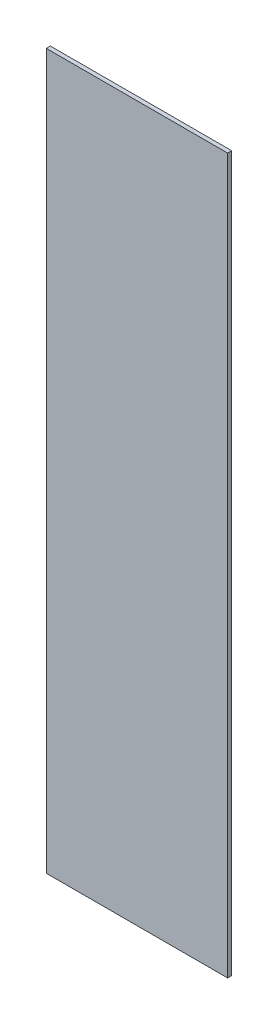
ISO-10303-21;
HEADER;
FILE_DESCRIPTION(('STEP AP214'),'2;1');
FILE_NAME('part.step','',(''),(''),'','','');
FILE_SCHEMA(('AUTOMOTIVE_DESIGN { 1 0 10303 214 1 1 1 1 }'));
ENDSEC;
DATA;
#1=APPLICATION_CONTEXT('core data for automotive mechanical design processes');
#2=APPLICATION_PROTOCOL_DEFINITION('international standard','automotive_design',2000,#1);
#3=PRODUCT_CONTEXT('',#1,'mechanical');
#4=PRODUCT('Part','Part','',(#3));
#5=PRODUCT_RELATED_PRODUCT_CATEGORY('part','',(#4));
#6=PRODUCT_DEFINITION_FORMATION('','',#4);
#7=PRODUCT_DEFINITION_CONTEXT('part definition',#1,'design');
#8=PRODUCT_DEFINITION('design','',#6,#7);
#9=PRODUCT_DEFINITION_SHAPE('','',#8);
#10=(LENGTH_UNIT() NAMED_UNIT(*) SI_UNIT(.MILLI.,.METRE.));
#11=(NAMED_UNIT(*) PLANE_ANGLE_UNIT() SI_UNIT($,.RADIAN.));
#12=(NAMED_UNIT(*) SI_UNIT($,.STERADIAN.) SOLID_ANGLE_UNIT());
#13=UNCERTAINTY_MEASURE_WITH_UNIT(LENGTH_MEASURE(1.E-05),#10,'distance_accuracy_value','');
#14=(GEOMETRIC_REPRESENTATION_CONTEXT(3) GLOBAL_UNCERTAINTY_ASSIGNED_CONTEXT((#13)) GLOBAL_UNIT_ASSIGNED_CONTEXT((#10,
#11,#12)) REPRESENTATION_CONTEXT('',''));
#15=CARTESIAN_POINT('',(0.,0.,0.));
#16=DIRECTION('',(0.,0.,1.));
#17=DIRECTION('',(1.,0.,0.));
#18=AXIS2_PLACEMENT_3D('',#15,#16,#17);
#19=CARTESIAN_POINT('',(-0.2868069251739,0.7412429894471,0.0009));
#20=DIRECTION('',(0.,1.,0.));
#21=DIRECTION('',(0.,0.,1.));
#22=AXIS2_PLACEMENT_3D('',#19,#20,#21);
#23=PLANE('',#22);
#24=DIRECTION('',(0.,0.,1.));
#25=VECTOR('',#24,1.);
#26=CARTESIAN_POINT('',(-0.3068107396239,0.7412429894471,0.));
#27=LINE('',#26,#25);
#28=CARTESIAN_POINT('',(-0.3068107396239,0.7412429894471,0.));
#29=VERTEX_POINT('',#28);
#30=CARTESIAN_POINT('',(-0.3068107396239,0.7412429894471,0.0009));
#31=VERTEX_POINT('',#30);
#32=EDGE_CURVE('E11',#29,#31,#27,.T.);
#33=ORIENTED_EDGE('',*,*,#32,.T.);
#34=DIRECTION('',(1.,0.,0.));
#35=VECTOR('',#34,1.);
#36=CARTESIAN_POINT('',(-0.3068107396239,0.7412429894471,0.0009));
#37=LINE('',#36,#35);
#38=CARTESIAN_POINT('',(-0.2668031107239,0.7412429894471,0.0009));
#39=VERTEX_POINT('',#38);
#40=EDGE_CURVE('E86',#31,#39,#37,.T.);
#41=ORIENTED_EDGE('',*,*,#40,.T.);
#42=DIRECTION('',(0.,0.,1.));
#43=VECTOR('',#42,1.);
#44=CARTESIAN_POINT('',(-0.2668031107239,0.7412429894471,0.));
#45=LINE('',#44,#43);
#46=CARTESIAN_POINT('',(-0.2668031107239,0.7412429894471,0.));
#47=VERTEX_POINT('',#46);
#48=EDGE_CURVE('E24',#47,#39,#45,.T.);
#49=ORIENTED_EDGE('',*,*,#48,.F.);
#50=DIRECTION('',(1.,0.,0.));
#51=VECTOR('',#50,1.);
#52=CARTESIAN_POINT('',(-0.3068107396239,0.7412429894471,0.));
#53=LINE('',#52,#51);
#54=EDGE_CURVE('E80',#29,#47,#53,.T.);
#55=ORIENTED_EDGE('',*,*,#54,.F.);
#56=EDGE_LOOP('',(#33,#41,#49,#55));
#57=FACE_BOUND('',#56,.T.);
#58=ADVANCED_FACE('F17',(#57),#23,.T.);
#59=CARTESIAN_POINT('',(-0.2668031107239,0.662452825082,0.0009));
#60=DIRECTION('',(1.,0.,0.));
#61=DIRECTION('',(0.,0.,-1.));
#62=AXIS2_PLACEMENT_3D('',#59,#60,#61);
#63=PLANE('',#62);
#64=ORIENTED_EDGE('',*,*,#48,.T.);
#65=DIRECTION('',(0.,-1.,0.));
#66=VECTOR('',#65,1.);
#67=CARTESIAN_POINT('',(-0.2668031107239,0.7412429894471,0.0009));
#68=LINE('',#67,#66);
#69=CARTESIAN_POINT('',(-0.2668031107239,0.5836626607169,0.0009));
#70=VERTEX_POINT('',#69);
#71=EDGE_CURVE('E64',#39,#70,#68,.T.);
#72=ORIENTED_EDGE('',*,*,#71,.T.);
#73=DIRECTION('',(0.,0.,1.));
#74=VECTOR('',#73,1.);
#75=CARTESIAN_POINT('',(-0.2668031107239,0.5836626607169,0.));
#76=LINE('',#75,#74);
#77=CARTESIAN_POINT('',(-0.2668031107239,0.5836626607169,0.));
#78=VERTEX_POINT('',#77);
#79=EDGE_CURVE('E84',#78,#70,#76,.T.);
#80=ORIENTED_EDGE('',*,*,#79,.F.);
#81=DIRECTION('',(0.,-1.,0.));
#82=VECTOR('',#81,1.);
#83=CARTESIAN_POINT('',(-0.2668031107239,0.7412429894471,0.));
#84=LINE('',#83,#82);
#85=EDGE_CURVE('E72',#47,#78,#84,.T.);
#86=ORIENTED_EDGE('',*,*,#85,.F.);
#87=EDGE_LOOP('',(#64,#72,#80,#86));
#88=FACE_BOUND('',#87,.T.);
#89=ADVANCED_FACE('F91',(#88),#63,.T.);
#90=CARTESIAN_POINT('',(-0.2868069251739,0.5836626607169,0.0009));
#91=DIRECTION('',(0.,-1.,0.));
#92=DIRECTION('',(0.,0.,-1.));
#93=AXIS2_PLACEMENT_3D('',#90,#91,#92);
#94=PLANE('',#93);
#95=ORIENTED_EDGE('',*,*,#79,.T.);
#96=DIRECTION('',(-1.,0.,0.));
#97=VECTOR('',#96,1.);
#98=CARTESIAN_POINT('',(-0.2668031107239,0.5836626607169,0.0009));
#99=LINE('',#98,#97);
#100=CARTESIAN_POINT('',(-0.3068107396239,0.5836626607169,0.0009));
#101=VERTEX_POINT('',#100);
#102=EDGE_CURVE('E60',#70,#101,#99,.T.);
#103=ORIENTED_EDGE('',*,*,#102,.T.);
#104=DIRECTION('',(0.,0.,1.));
#105=VECTOR('',#104,1.);
#106=CARTESIAN_POINT('',(-0.3068107396239,0.5836626607169,0.));
#107=LINE('',#106,#105);
#108=CARTESIAN_POINT('',(-0.3068107396239,0.5836626607169,0.));
#109=VERTEX_POINT('',#108);
#110=EDGE_CURVE('E55',#109,#101,#107,.T.);
#111=ORIENTED_EDGE('',*,*,#110,.F.);
#112=DIRECTION('',(-1.,0.,0.));
#113=VECTOR('',#112,1.);
#114=CARTESIAN_POINT('',(-0.2668031107239,0.5836626607169,0.));
#115=LINE('',#114,#113);
#116=EDGE_CURVE('E58',#78,#109,#115,.T.);
#117=ORIENTED_EDGE('',*,*,#116,.F.);
#118=EDGE_LOOP('',(#95,#103,#111,#117));
#119=FACE_BOUND('',#118,.T.);
#120=ADVANCED_FACE('F57',(#119),#94,.T.);
#121=CARTESIAN_POINT('',(-0.3068107396239,0.662452825082,0.0009));
#122=DIRECTION('',(-1.,0.,0.));
#123=DIRECTION('',(0.,0.,1.));
#124=AXIS2_PLACEMENT_3D('',#121,#122,#123);
#125=PLANE('',#124);
#126=ORIENTED_EDGE('',*,*,#110,.T.);
#127=DIRECTION('',(0.,1.,0.));
#128=VECTOR('',#127,1.);
#129=CARTESIAN_POINT('',(-0.3068107396239,0.5836626607169,0.0009));
#130=LINE('',#129,#128);
#131=EDGE_CURVE('E78',#101,#31,#130,.T.);
#132=ORIENTED_EDGE('',*,*,#131,.T.);
#133=ORIENTED_EDGE('',*,*,#32,.F.);
#134=DIRECTION('',(0.,1.,0.));
#135=VECTOR('',#134,1.);
#136=CARTESIAN_POINT('',(-0.3068107396239,0.5836626607169,0.));
#137=LINE('',#136,#135);
#138=EDGE_CURVE('E71',#109,#29,#137,.T.);
#139=ORIENTED_EDGE('',*,*,#138,.F.);
#140=EDGE_LOOP('',(#126,#132,#133,#139));
#141=FACE_BOUND('',#140,.T.);
#142=ADVANCED_FACE('F74',(#141),#125,.T.);
#143=CARTESIAN_POINT('',(-0.2868069251739,0.5836626607169,0.));
#144=DIRECTION('',(0.,0.,1.));
#145=DIRECTION('',(1.,0.,0.));
#146=AXIS2_PLACEMENT_3D('',#143,#144,#145);
#147=PLANE('',#146);
#148=ORIENTED_EDGE('',*,*,#54,.T.);
#149=ORIENTED_EDGE('',*,*,#85,.T.);
#150=ORIENTED_EDGE('',*,*,#116,.T.);
#151=ORIENTED_EDGE('',*,*,#138,.T.);
#152=EDGE_LOOP('',(#148,#149,#150,#151));
#153=FACE_BOUND('',#152,.T.);
#154=ADVANCED_FACE('F70',(#153),#147,.F.);
#155=CARTESIAN_POINT('',(-0.2868069251739,0.5836626607169,0.0009));
#156=DIRECTION('',(0.,0.,1.));
#157=DIRECTION('',(1.,0.,0.));
#158=AXIS2_PLACEMENT_3D('',#155,#156,#157);
#159=PLANE('',#158);
#160=ORIENTED_EDGE('',*,*,#40,.F.);
#161=ORIENTED_EDGE('',*,*,#131,.F.);
#162=ORIENTED_EDGE('',*,*,#102,.F.);
#163=ORIENTED_EDGE('',*,*,#71,.F.);
#164=EDGE_LOOP('',(#160,#161,#162,#163));
#165=FACE_BOUND('',#164,.T.);
#166=ADVANCED_FACE('F90',(#165),#159,.T.);
#167=CLOSED_SHELL('',(#58,#89,#120,#142,#154,#166));
#168=MANIFOLD_SOLID_BREP('B1',#167);
#169=ADVANCED_BREP_SHAPE_REPRESENTATION('',(#18,#168),#14);
#170=SHAPE_DEFINITION_REPRESENTATION(#9,#169);
ENDSEC;
END-ISO-10303-21;
